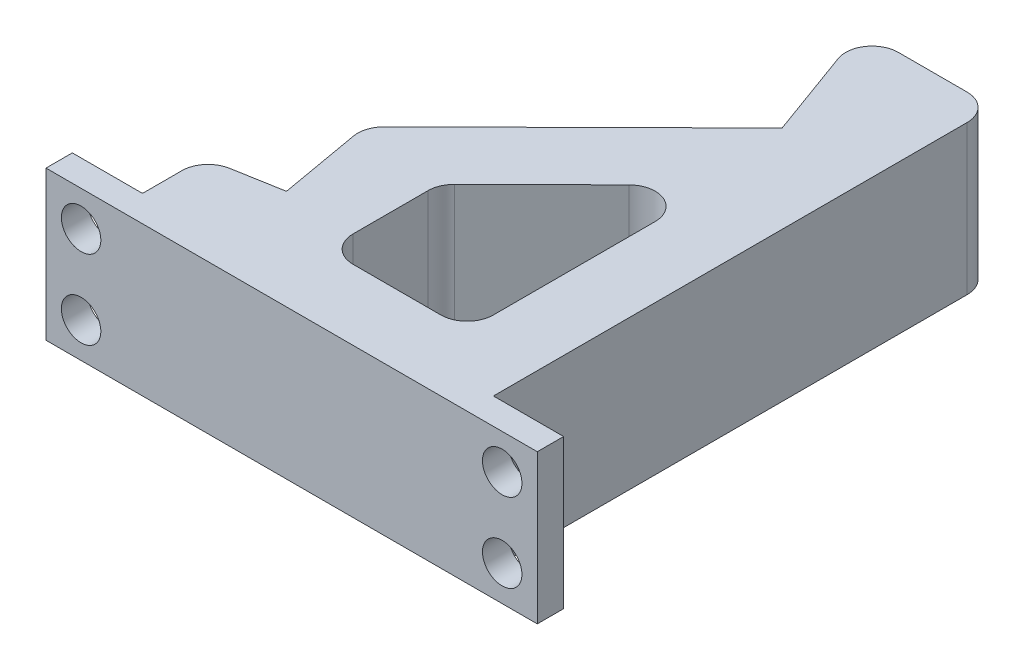
ISO-10303-21;
HEADER;
FILE_DESCRIPTION(('STEP AP214'),'2;1');
FILE_NAME('part.step','',(''),(''),'','','');
FILE_SCHEMA(('AUTOMOTIVE_DESIGN { 1 0 10303 214 1 1 1 1 }'));
ENDSEC;
DATA;
#1=APPLICATION_CONTEXT('core data for automotive mechanical design processes');
#2=APPLICATION_PROTOCOL_DEFINITION('international standard','automotive_design',2000,#1);
#3=PRODUCT_CONTEXT('',#1,'mechanical');
#4=PRODUCT('Part','Part','',(#3));
#5=PRODUCT_RELATED_PRODUCT_CATEGORY('part','',(#4));
#6=PRODUCT_DEFINITION_FORMATION('','',#4);
#7=PRODUCT_DEFINITION_CONTEXT('part definition',#1,'design');
#8=PRODUCT_DEFINITION('design','',#6,#7);
#9=PRODUCT_DEFINITION_SHAPE('','',#8);
#10=(LENGTH_UNIT() NAMED_UNIT(*) SI_UNIT(.MILLI.,.METRE.));
#11=(NAMED_UNIT(*) PLANE_ANGLE_UNIT() SI_UNIT($,.RADIAN.));
#12=(NAMED_UNIT(*) SI_UNIT($,.STERADIAN.) SOLID_ANGLE_UNIT());
#13=UNCERTAINTY_MEASURE_WITH_UNIT(LENGTH_MEASURE(1.E-05),#10,'distance_accuracy_value','');
#14=(GEOMETRIC_REPRESENTATION_CONTEXT(3) GLOBAL_UNCERTAINTY_ASSIGNED_CONTEXT((#13)) GLOBAL_UNIT_ASSIGNED_CONTEXT((#10,
#11,#12)) REPRESENTATION_CONTEXT('',''));
#15=CARTESIAN_POINT('',(0.,0.,0.));
#16=DIRECTION('',(0.,0.,1.));
#17=DIRECTION('',(1.,0.,0.));
#18=AXIS2_PLACEMENT_3D('',#15,#16,#17);
#19=CARTESIAN_POINT('',(0.,8.5,0.));
#20=DIRECTION('',(0.,1.,0.));
#21=DIRECTION('',(0.,0.,1.));
#22=AXIS2_PLACEMENT_3D('',#19,#20,#21);
#23=PLANE('',#22);
#24=DIRECTION('',(1.,0.,0.));
#25=VECTOR('',#24,1.);
#26=CARTESIAN_POINT('',(0.,8.5,0.));
#27=LINE('',#26,#25);
#28=CARTESIAN_POINT('',(-8.,8.5,0.));
#29=VERTEX_POINT('',#28);
#30=CARTESIAN_POINT('',(48.,8.5,0.));
#31=VERTEX_POINT('',#30);
#32=EDGE_CURVE('E280',#29,#31,#27,.T.);
#33=ORIENTED_EDGE('',*,*,#32,.T.);
#34=DIRECTION('',(0.,0.,-1.));
#35=VECTOR('',#34,1.);
#36=CARTESIAN_POINT('',(48.,8.5,0.));
#37=LINE('',#36,#35);
#38=CARTESIAN_POINT('',(48.,8.5,-3.00000000000001));
#39=VERTEX_POINT('',#38);
#40=EDGE_CURVE('E236',#31,#39,#37,.T.);
#41=ORIENTED_EDGE('',*,*,#40,.T.);
#42=DIRECTION('',(-1.,0.,0.));
#43=VECTOR('',#42,1.);
#44=CARTESIAN_POINT('',(40.,8.5,-3.00000000000001));
#45=LINE('',#44,#43);
#46=CARTESIAN_POINT('',(40.,8.5,-3.00000000000001));
#47=VERTEX_POINT('',#46);
#48=EDGE_CURVE('E740',#39,#47,#45,.T.);
#49=ORIENTED_EDGE('',*,*,#48,.T.);
#50=DIRECTION('',(0.,0.,-1.));
#51=VECTOR('',#50,1.);
#52=CARTESIAN_POINT('',(40.,8.5,0.));
#53=LINE('',#52,#51);
#54=CARTESIAN_POINT('',(40.,8.5,-57.));
#55=VERTEX_POINT('',#54);
#56=EDGE_CURVE('E60',#47,#55,#53,.T.);
#57=ORIENTED_EDGE('',*,*,#56,.T.);
#58=CARTESIAN_POINT('',(37.,8.5,-57.));
#59=DIRECTION('',(0.,1.,0.));
#60=DIRECTION('',(0.,0.,1.));
#61=AXIS2_PLACEMENT_3D('',#58,#59,#60);
#62=CIRCLE('',#61,3.);
#63=CARTESIAN_POINT('',(37.,8.5,-60.));
#64=VERTEX_POINT('',#63);
#65=EDGE_CURVE('E339',#55,#64,#62,.T.);
#66=ORIENTED_EDGE('',*,*,#65,.T.);
#67=DIRECTION('',(-1.,0.,0.));
#68=VECTOR('',#67,1.);
#69=CARTESIAN_POINT('',(40.,8.5,-60.));
#70=LINE('',#69,#68);
#71=CARTESIAN_POINT('',(29.1541418703413,8.5,-60.));
#72=VERTEX_POINT('',#71);
#73=EDGE_CURVE('E283',#64,#72,#70,.T.);
#74=ORIENTED_EDGE('',*,*,#73,.T.);
#75=CARTESIAN_POINT('',(29.1541418703413,8.5,-57.));
#76=DIRECTION('',(0.,1.,0.));
#77=DIRECTION('',(0.,0.,1.));
#78=AXIS2_PLACEMENT_3D('',#75,#76,#77);
#79=CIRCLE('',#78,3.);
#80=CARTESIAN_POINT('',(26.3350640079835,8.5,-55.973939570023));
#81=VERTEX_POINT('',#80);
#82=EDGE_CURVE('E333',#72,#81,#79,.T.);
#83=ORIENTED_EDGE('',*,*,#82,.T.);
#84=DIRECTION('',(0.342020143325673,0.,0.939692620785907));
#85=VECTOR('',#84,1.);
#86=CARTESIAN_POINT('',(24.8696978501149,8.5,-60.));
#87=LINE('',#86,#85);
#88=CARTESIAN_POINT('',(30.,8.5,-45.9046106882114));
#89=VERTEX_POINT('',#88);
#90=EDGE_CURVE('E286',#81,#89,#87,.T.);
#91=ORIENTED_EDGE('',*,*,#90,.T.);
#92=DIRECTION('',(-0.710798523017317,0.,0.703395663674721));
#93=VECTOR('',#92,1.);
#94=CARTESIAN_POINT('',(30.,8.5,-45.9046106882114));
#95=LINE('',#94,#93);
#96=CARTESIAN_POINT('',(7.20702820738755,8.5,-23.3490242568743));
#97=VERTEX_POINT('',#96);
#98=EDGE_CURVE('E288',#89,#97,#95,.T.);
#99=ORIENTED_EDGE('',*,*,#98,.T.);
#100=CARTESIAN_POINT('',(9.3172151984117,8.5,-21.2166286878224));
#101=DIRECTION('',(0.,1.,0.));
#102=DIRECTION('',(0.,0.,1.));
#103=AXIS2_PLACEMENT_3D('',#100,#101,#102);
#104=CIRCLE('',#103,3.);
#105=CARTESIAN_POINT('',(6.36279193937507,8.5,-20.6956841548216));
#106=VERTEX_POINT('',#105);
#107=EDGE_CURVE('E335',#97,#106,#104,.T.);
#108=ORIENTED_EDGE('',*,*,#107,.T.);
#109=DIRECTION('',(0.173648177666927,0.,0.984807753012209));
#110=VECTOR('',#109,1.);
#111=CARTESIAN_POINT('',(6.0898700456638,8.5,-22.243501128802));
#112=LINE('',#111,#110);
#113=CARTESIAN_POINT('',(8.,8.5,-11.4106158456677));
#114=VERTEX_POINT('',#113);
#115=EDGE_CURVE('E291',#106,#114,#112,.T.);
#116=ORIENTED_EDGE('',*,*,#115,.T.);
#117=DIRECTION('',(-0.984807753012209,0.,0.173648177666927));
#118=VECTOR('',#117,1.);
#119=CARTESIAN_POINT('',(8.,8.5,-11.4106158456677));
#120=LINE('',#119,#118);
#121=CARTESIAN_POINT('',(2.47905546699922,8.5,-10.4371243655048));
#122=VERTEX_POINT('',#121);
#123=EDGE_CURVE('E293',#114,#122,#120,.T.);
#124=ORIENTED_EDGE('',*,*,#123,.T.);
#125=CARTESIAN_POINT('',(3.,8.5,-7.48270110646815));
#126=DIRECTION('',(0.,1.,0.));
#127=DIRECTION('',(0.,0.,1.));
#128=AXIS2_PLACEMENT_3D('',#125,#126,#127);
#129=CIRCLE('',#128,3.);
#130=CARTESIAN_POINT('',(0.,8.5,-7.48270110646815));
#131=VERTEX_POINT('',#130);
#132=EDGE_CURVE('E337',#122,#131,#129,.T.);
#133=ORIENTED_EDGE('',*,*,#132,.T.);
#134=DIRECTION('',(0.,0.,1.));
#135=VECTOR('',#134,1.);
#136=CARTESIAN_POINT('',(0.,8.5,0.));
#137=LINE('',#136,#135);
#138=CARTESIAN_POINT('',(0.,8.5,-3.));
#139=VERTEX_POINT('',#138);
#140=EDGE_CURVE('E296',#131,#139,#137,.T.);
#141=ORIENTED_EDGE('',*,*,#140,.T.);
#142=DIRECTION('',(-1.,0.,0.));
#143=VECTOR('',#142,1.);
#144=CARTESIAN_POINT('',(0.,8.5,-3.));
#145=LINE('',#144,#143);
#146=CARTESIAN_POINT('',(-8.,8.5,-3.));
#147=VERTEX_POINT('',#146);
#148=EDGE_CURVE('E243',#139,#147,#145,.T.);
#149=ORIENTED_EDGE('',*,*,#148,.T.);
#150=DIRECTION('',(0.,0.,1.));
#151=VECTOR('',#150,1.);
#152=CARTESIAN_POINT('',(-8.,8.5,0.));
#153=LINE('',#152,#151);
#154=EDGE_CURVE('E246',#147,#29,#153,.T.);
#155=ORIENTED_EDGE('',*,*,#154,.T.);
#156=EDGE_LOOP('',(#33,#41,#49,#57,#66,#74,#83,#91,#99,#108,#116,#124,#133,#141,#149,#155));
#157=FACE_BOUND('',#156,.T.);
#158=DIRECTION('',(1.,0.,0.));
#159=VECTOR('',#158,1.);
#160=CARTESIAN_POINT('',(16.,8.5,-8.));
#161=LINE('',#160,#159);
#162=CARTESIAN_POINT('',(19.,8.5,-8.));
#163=VERTEX_POINT('',#162);
#164=CARTESIAN_POINT('',(29.,8.5,-8.));
#165=VERTEX_POINT('',#164);
#166=EDGE_CURVE('E260',#163,#165,#161,.T.);
#167=ORIENTED_EDGE('',*,*,#166,.F.);
#168=CARTESIAN_POINT('',(19.,8.5,-11.));
#169=DIRECTION('',(0.,1.,0.));
#170=DIRECTION('',(0.,0.,1.));
#171=AXIS2_PLACEMENT_3D('',#168,#169,#170);
#172=CIRCLE('',#171,3.);
#173=CARTESIAN_POINT('',(16.,8.5,-11.));
#174=VERTEX_POINT('',#173);
#175=EDGE_CURVE('E375',#163,#174,#172,.F.);
#176=ORIENTED_EDGE('',*,*,#175,.T.);
#177=DIRECTION('',(0.,0.,1.));
#178=VECTOR('',#177,1.);
#179=CARTESIAN_POINT('',(16.,8.5,-20.7954711592154));
#180=LINE('',#179,#178);
#181=CARTESIAN_POINT('',(16.,8.5,-19.5436213309425));
#182=VERTEX_POINT('',#181);
#183=EDGE_CURVE('E257',#182,#174,#180,.T.);
#184=ORIENTED_EDGE('',*,*,#183,.F.);
#185=CARTESIAN_POINT('',(19.,8.5,-19.5436213309425));
#186=DIRECTION('',(0.,1.,0.));
#187=DIRECTION('',(0.,0.,1.));
#188=AXIS2_PLACEMENT_3D('',#185,#186,#187);
#189=CIRCLE('',#188,3.);
#190=CARTESIAN_POINT('',(16.8898130089758,8.5,-21.6760168999945));
#191=VERTEX_POINT('',#190);
#192=EDGE_CURVE('E379',#182,#191,#189,.F.);
#193=ORIENTED_EDGE('',*,*,#192,.T.);
#194=DIRECTION('',(-0.710798523017317,0.,0.703395663674721));
#195=VECTOR('',#194,1.);
#196=CARTESIAN_POINT('',(32.,8.5,-36.628833573956));
#197=LINE('',#196,#195);
#198=CARTESIAN_POINT('',(26.8898130089758,8.5,-31.5718684092074));
#199=VERTEX_POINT('',#198);
#200=EDGE_CURVE('E267',#199,#191,#197,.T.);
#201=ORIENTED_EDGE('',*,*,#200,.F.);
#202=CARTESIAN_POINT('',(29.,8.5,-29.4394728401554));
#203=DIRECTION('',(0.,1.,0.));
#204=DIRECTION('',(0.,0.,1.));
#205=AXIS2_PLACEMENT_3D('',#202,#203,#204);
#206=CIRCLE('',#205,3.);
#207=CARTESIAN_POINT('',(32.,8.5,-29.4394728401554));
#208=VERTEX_POINT('',#207);
#209=EDGE_CURVE('E383',#199,#208,#206,.F.);
#210=ORIENTED_EDGE('',*,*,#209,.T.);
#211=DIRECTION('',(0.,0.,-1.));
#212=VECTOR('',#211,1.);
#213=CARTESIAN_POINT('',(32.,8.5,-8.));
#214=LINE('',#213,#212);
#215=CARTESIAN_POINT('',(32.,8.5,-11.));
#216=VERTEX_POINT('',#215);
#217=EDGE_CURVE('E264',#216,#208,#214,.T.);
#218=ORIENTED_EDGE('',*,*,#217,.F.);
#219=CARTESIAN_POINT('',(29.,8.5,-11.));
#220=DIRECTION('',(0.,1.,0.));
#221=DIRECTION('',(0.,0.,1.));
#222=AXIS2_PLACEMENT_3D('',#219,#220,#221);
#223=CIRCLE('',#222,3.);
#224=EDGE_CURVE('E11',#216,#165,#223,.F.);
#225=ORIENTED_EDGE('',*,*,#224,.T.);
#226=EDGE_LOOP('',(#167,#176,#184,#193,#201,#210,#218,#225));
#227=FACE_BOUND('',#226,.T.);
#228=ADVANCED_FACE('F45',(#157,#227),#23,.T.);
#229=CARTESIAN_POINT('',(0.,-8.5,0.));
#230=DIRECTION('',(0.,1.,0.));
#231=DIRECTION('',(0.,0.,1.));
#232=AXIS2_PLACEMENT_3D('',#229,#230,#231);
#233=PLANE('',#232);
#234=DIRECTION('',(-1.,0.,0.));
#235=VECTOR('',#234,1.);
#236=CARTESIAN_POINT('',(40.,-8.5,-60.));
#237=LINE('',#236,#235);
#238=CARTESIAN_POINT('',(37.,-8.5,-60.));
#239=VERTEX_POINT('',#238);
#240=CARTESIAN_POINT('',(29.1541418703413,-8.5,-60.));
#241=VERTEX_POINT('',#240);
#242=EDGE_CURVE('E216',#239,#241,#237,.T.);
#243=ORIENTED_EDGE('',*,*,#242,.F.);
#244=CARTESIAN_POINT('',(37.,-8.5,-57.));
#245=DIRECTION('',(0.,1.,0.));
#246=DIRECTION('',(0.,0.,1.));
#247=AXIS2_PLACEMENT_3D('',#244,#245,#246);
#248=CIRCLE('',#247,3.);
#249=CARTESIAN_POINT('',(40.,-8.5,-57.));
#250=VERTEX_POINT('',#249);
#251=EDGE_CURVE('E214',#239,#250,#248,.F.);
#252=ORIENTED_EDGE('',*,*,#251,.T.);
#253=DIRECTION('',(0.,0.,-1.));
#254=VECTOR('',#253,1.);
#255=CARTESIAN_POINT('',(40.,-8.5,0.));
#256=LINE('',#255,#254);
#257=CARTESIAN_POINT('',(40.,-8.5,-3.00000000000001));
#258=VERTEX_POINT('',#257);
#259=EDGE_CURVE('E206',#258,#250,#256,.T.);
#260=ORIENTED_EDGE('',*,*,#259,.F.);
#261=DIRECTION('',(1.,0.,0.));
#262=VECTOR('',#261,1.);
#263=CARTESIAN_POINT('',(40.,-8.5,-3.00000000000001));
#264=LINE('',#263,#262);
#265=CARTESIAN_POINT('',(48.,-8.5,-3.00000000000001));
#266=VERTEX_POINT('',#265);
#267=EDGE_CURVE('E212',#258,#266,#264,.T.);
#268=ORIENTED_EDGE('',*,*,#267,.T.);
#269=DIRECTION('',(0.,0.,1.));
#270=VECTOR('',#269,1.);
#271=CARTESIAN_POINT('',(48.,-8.5,0.));
#272=LINE('',#271,#270);
#273=CARTESIAN_POINT('',(48.,-8.5,0.));
#274=VERTEX_POINT('',#273);
#275=EDGE_CURVE('E225',#266,#274,#272,.T.);
#276=ORIENTED_EDGE('',*,*,#275,.T.);
#277=DIRECTION('',(1.,0.,0.));
#278=VECTOR('',#277,1.);
#279=CARTESIAN_POINT('',(0.,-8.5,0.));
#280=LINE('',#279,#278);
#281=CARTESIAN_POINT('',(-8.,-8.5,0.));
#282=VERTEX_POINT('',#281);
#283=EDGE_CURVE('E217',#282,#274,#280,.T.);
#284=ORIENTED_EDGE('',*,*,#283,.F.);
#285=DIRECTION('',(0.,0.,-1.));
#286=VECTOR('',#285,1.);
#287=CARTESIAN_POINT('',(-8.,-8.5,0.));
#288=LINE('',#287,#286);
#289=CARTESIAN_POINT('',(-8.,-8.5,-3.));
#290=VERTEX_POINT('',#289);
#291=EDGE_CURVE('E239',#282,#290,#288,.T.);
#292=ORIENTED_EDGE('',*,*,#291,.T.);
#293=DIRECTION('',(1.,0.,0.));
#294=VECTOR('',#293,1.);
#295=CARTESIAN_POINT('',(0.,-8.5,-3.));
#296=LINE('',#295,#294);
#297=CARTESIAN_POINT('',(0.,-8.5,-3.));
#298=VERTEX_POINT('',#297);
#299=EDGE_CURVE('E241',#290,#298,#296,.T.);
#300=ORIENTED_EDGE('',*,*,#299,.T.);
#301=DIRECTION('',(0.,0.,1.));
#302=VECTOR('',#301,1.);
#303=CARTESIAN_POINT('',(0.,-8.5,0.));
#304=LINE('',#303,#302);
#305=CARTESIAN_POINT('',(0.,-8.5,-7.48270110646815));
#306=VERTEX_POINT('',#305);
#307=EDGE_CURVE('E68',#306,#298,#304,.T.);
#308=ORIENTED_EDGE('',*,*,#307,.F.);
#309=CARTESIAN_POINT('',(3.,-8.5,-7.48270110646815));
#310=DIRECTION('',(0.,1.,0.));
#311=DIRECTION('',(0.,0.,1.));
#312=AXIS2_PLACEMENT_3D('',#309,#310,#311);
#313=CIRCLE('',#312,3.);
#314=CARTESIAN_POINT('',(2.47905546699922,-8.5,-10.4371243655048));
#315=VERTEX_POINT('',#314);
#316=EDGE_CURVE('E328',#306,#315,#313,.F.);
#317=ORIENTED_EDGE('',*,*,#316,.T.);
#318=DIRECTION('',(-0.984807753012209,0.,0.173648177666927));
#319=VECTOR('',#318,1.);
#320=CARTESIAN_POINT('',(8.,-8.5,-11.4106158456677));
#321=LINE('',#320,#319);
#322=CARTESIAN_POINT('',(8.,-8.5,-11.4106158456677));
#323=VERTEX_POINT('',#322);
#324=EDGE_CURVE('E310',#323,#315,#321,.T.);
#325=ORIENTED_EDGE('',*,*,#324,.F.);
#326=DIRECTION('',(0.173648177666927,0.,0.984807753012209));
#327=VECTOR('',#326,1.);
#328=CARTESIAN_POINT('',(6.0898700456638,-8.5,-22.243501128802));
#329=LINE('',#328,#327);
#330=CARTESIAN_POINT('',(6.36279193937507,-8.5,-20.6956841548216));
#331=VERTEX_POINT('',#330);
#332=EDGE_CURVE('E308',#331,#323,#329,.T.);
#333=ORIENTED_EDGE('',*,*,#332,.F.);
#334=CARTESIAN_POINT('',(9.3172151984117,-8.5,-21.2166286878224));
#335=DIRECTION('',(0.,1.,0.));
#336=DIRECTION('',(0.,0.,1.));
#337=AXIS2_PLACEMENT_3D('',#334,#335,#336);
#338=CIRCLE('',#337,3.);
#339=CARTESIAN_POINT('',(7.20702820738755,-8.5,-23.3490242568743));
#340=VERTEX_POINT('',#339);
#341=EDGE_CURVE('E326',#331,#340,#338,.F.);
#342=ORIENTED_EDGE('',*,*,#341,.T.);
#343=DIRECTION('',(-0.710798523017317,0.,0.703395663674721));
#344=VECTOR('',#343,1.);
#345=CARTESIAN_POINT('',(30.,-8.5,-45.9046106882114));
#346=LINE('',#345,#344);
#347=CARTESIAN_POINT('',(30.,-8.5,-45.9046106882114));
#348=VERTEX_POINT('',#347);
#349=EDGE_CURVE('E305',#348,#340,#346,.T.);
#350=ORIENTED_EDGE('',*,*,#349,.F.);
#351=DIRECTION('',(0.342020143325673,0.,0.939692620785907));
#352=VECTOR('',#351,1.);
#353=CARTESIAN_POINT('',(24.8696978501149,-8.5,-60.));
#354=LINE('',#353,#352);
#355=CARTESIAN_POINT('',(26.3350640079835,-8.5,-55.973939570023));
#356=VERTEX_POINT('',#355);
#357=EDGE_CURVE('E303',#356,#348,#354,.T.);
#358=ORIENTED_EDGE('',*,*,#357,.F.);
#359=CARTESIAN_POINT('',(29.1541418703413,-8.5,-57.));
#360=DIRECTION('',(0.,1.,0.));
#361=DIRECTION('',(0.,0.,1.));
#362=AXIS2_PLACEMENT_3D('',#359,#360,#361);
#363=CIRCLE('',#362,3.);
#364=EDGE_CURVE('E324',#356,#241,#363,.F.);
#365=ORIENTED_EDGE('',*,*,#364,.T.);
#366=EDGE_LOOP('',(#243,#252,#260,#268,#276,#284,#292,#300,#308,#317,#325,#333,#342,#350,#358,#365));
#367=FACE_BOUND('',#366,.T.);
#368=DIRECTION('',(-0.710798523017317,0.,0.703395663674721));
#369=VECTOR('',#368,1.);
#370=CARTESIAN_POINT('',(32.,-8.5,-36.628833573956));
#371=LINE('',#370,#369);
#372=CARTESIAN_POINT('',(26.8898130089758,-8.5,-31.5718684092074));
#373=VERTEX_POINT('',#372);
#374=CARTESIAN_POINT('',(16.8898130089758,-8.5,-21.6760168999945));
#375=VERTEX_POINT('',#374);
#376=EDGE_CURVE('E261',#373,#375,#371,.T.);
#377=ORIENTED_EDGE('',*,*,#376,.T.);
#378=CARTESIAN_POINT('',(19.,-8.5,-19.5436213309425));
#379=DIRECTION('',(0.,1.,0.));
#380=DIRECTION('',(0.,0.,1.));
#381=AXIS2_PLACEMENT_3D('',#378,#379,#380);
#382=CIRCLE('',#381,3.);
#383=CARTESIAN_POINT('',(16.,-8.5,-19.5436213309425));
#384=VERTEX_POINT('',#383);
#385=EDGE_CURVE('E377',#375,#384,#382,.T.);
#386=ORIENTED_EDGE('',*,*,#385,.T.);
#387=DIRECTION('',(0.,0.,1.));
#388=VECTOR('',#387,1.);
#389=CARTESIAN_POINT('',(16.,-8.5,-20.7954711592154));
#390=LINE('',#389,#388);
#391=CARTESIAN_POINT('',(16.,-8.5,-11.));
#392=VERTEX_POINT('',#391);
#393=EDGE_CURVE('E256',#384,#392,#390,.T.);
#394=ORIENTED_EDGE('',*,*,#393,.T.);
#395=CARTESIAN_POINT('',(19.,-8.5,-11.));
#396=DIRECTION('',(0.,1.,0.));
#397=DIRECTION('',(0.,0.,1.));
#398=AXIS2_PLACEMENT_3D('',#395,#396,#397);
#399=CIRCLE('',#398,3.);
#400=CARTESIAN_POINT('',(19.,-8.5,-8.));
#401=VERTEX_POINT('',#400);
#402=EDGE_CURVE('E373',#392,#401,#399,.T.);
#403=ORIENTED_EDGE('',*,*,#402,.T.);
#404=DIRECTION('',(1.,0.,0.));
#405=VECTOR('',#404,1.);
#406=CARTESIAN_POINT('',(16.,-8.5,-8.));
#407=LINE('',#406,#405);
#408=CARTESIAN_POINT('',(29.,-8.5,-8.));
#409=VERTEX_POINT('',#408);
#410=EDGE_CURVE('E272',#401,#409,#407,.T.);
#411=ORIENTED_EDGE('',*,*,#410,.T.);
#412=CARTESIAN_POINT('',(29.,-8.5,-11.));
#413=DIRECTION('',(0.,1.,0.));
#414=DIRECTION('',(0.,0.,1.));
#415=AXIS2_PLACEMENT_3D('',#412,#413,#414);
#416=CIRCLE('',#415,3.);
#417=CARTESIAN_POINT('',(32.,-8.5,-11.));
#418=VERTEX_POINT('',#417);
#419=EDGE_CURVE('E53',#409,#418,#416,.T.);
#420=ORIENTED_EDGE('',*,*,#419,.T.);
#421=DIRECTION('',(0.,0.,-1.));
#422=VECTOR('',#421,1.);
#423=CARTESIAN_POINT('',(32.,-8.5,-8.));
#424=LINE('',#423,#422);
#425=CARTESIAN_POINT('',(32.,-8.5,-29.4394728401554));
#426=VERTEX_POINT('',#425);
#427=EDGE_CURVE('E275',#418,#426,#424,.T.);
#428=ORIENTED_EDGE('',*,*,#427,.T.);
#429=CARTESIAN_POINT('',(29.,-8.5,-29.4394728401554));
#430=DIRECTION('',(0.,1.,0.));
#431=DIRECTION('',(0.,0.,1.));
#432=AXIS2_PLACEMENT_3D('',#429,#430,#431);
#433=CIRCLE('',#432,3.);
#434=EDGE_CURVE('E381',#426,#373,#433,.T.);
#435=ORIENTED_EDGE('',*,*,#434,.T.);
#436=EDGE_LOOP('',(#377,#386,#394,#403,#411,#420,#428,#435));
#437=FACE_BOUND('',#436,.T.);
#438=ADVANCED_FACE('F208',(#367,#437),#233,.F.);
#439=CARTESIAN_POINT('',(0.,8.5,0.));
#440=DIRECTION('',(0.,0.,-1.));
#441=DIRECTION('',(-1.,0.,0.));
#442=AXIS2_PLACEMENT_3D('',#439,#440,#441);
#443=PLANE('',#442);
#444=CARTESIAN_POINT('',(44.,-4.5,0.));
#445=DIRECTION('',(0.,0.,-1.));
#446=DIRECTION('',(-1.,0.,0.));
#447=AXIS2_PLACEMENT_3D('',#444,#445,#446);
#448=CIRCLE('',#447,2.25);
#449=CARTESIAN_POINT('',(41.75,-4.5,0.));
#450=VERTEX_POINT('',#449);
#451=EDGE_CURVE('E734',#450,#450,#448,.T.);
#452=ORIENTED_EDGE('',*,*,#451,.T.);
#453=EDGE_LOOP('',(#452));
#454=FACE_BOUND('',#453,.T.);
#455=CARTESIAN_POINT('',(44.,4.5,0.));
#456=DIRECTION('',(0.,0.,-1.));
#457=DIRECTION('',(-1.,0.,0.));
#458=AXIS2_PLACEMENT_3D('',#455,#456,#457);
#459=CIRCLE('',#458,2.25);
#460=CARTESIAN_POINT('',(41.75,4.5,0.));
#461=VERTEX_POINT('',#460);
#462=EDGE_CURVE('E728',#461,#461,#459,.T.);
#463=ORIENTED_EDGE('',*,*,#462,.T.);
#464=EDGE_LOOP('',(#463));
#465=FACE_BOUND('',#464,.T.);
#466=CARTESIAN_POINT('',(-4.,4.5,0.));
#467=DIRECTION('',(0.,0.,-1.));
#468=DIRECTION('',(-1.,0.,0.));
#469=AXIS2_PLACEMENT_3D('',#466,#467,#468);
#470=CIRCLE('',#469,2.25);
#471=CARTESIAN_POINT('',(-6.25,4.5,0.));
#472=VERTEX_POINT('',#471);
#473=EDGE_CURVE('E716',#472,#472,#470,.T.);
#474=ORIENTED_EDGE('',*,*,#473,.T.);
#475=EDGE_LOOP('',(#474));
#476=FACE_BOUND('',#475,.T.);
#477=CARTESIAN_POINT('',(-4.,-4.5,0.));
#478=DIRECTION('',(0.,0.,-1.));
#479=DIRECTION('',(-1.,0.,0.));
#480=AXIS2_PLACEMENT_3D('',#477,#478,#479);
#481=CIRCLE('',#480,2.25);
#482=CARTESIAN_POINT('',(-6.25,-4.5,0.));
#483=VERTEX_POINT('',#482);
#484=EDGE_CURVE('E229',#483,#483,#481,.T.);
#485=ORIENTED_EDGE('',*,*,#484,.T.);
#486=EDGE_LOOP('',(#485));
#487=FACE_BOUND('',#486,.T.);
#488=ORIENTED_EDGE('',*,*,#283,.T.);
#489=DIRECTION('',(0.,1.,0.));
#490=VECTOR('',#489,1.);
#491=CARTESIAN_POINT('',(48.,-17.0440037453175,0.));
#492=LINE('',#491,#490);
#493=EDGE_CURVE('E737',#274,#31,#492,.T.);
#494=ORIENTED_EDGE('',*,*,#493,.T.);
#495=ORIENTED_EDGE('',*,*,#32,.F.);
#496=DIRECTION('',(0.,1.,0.));
#497=VECTOR('',#496,1.);
#498=CARTESIAN_POINT('',(-8.,-17.0440037453175,0.));
#499=LINE('',#498,#497);
#500=EDGE_CURVE('E242',#282,#29,#499,.T.);
#501=ORIENTED_EDGE('',*,*,#500,.F.);
#502=EDGE_LOOP('',(#488,#494,#495,#501));
#503=FACE_BOUND('',#502,.T.);
#504=ADVANCED_FACE('F437',(#454,#465,#476,#487,#503),#443,.F.);
#505=CARTESIAN_POINT('',(40.,8.5,0.));
#506=DIRECTION('',(-1.,0.,0.));
#507=DIRECTION('',(0.,0.,1.));
#508=AXIS2_PLACEMENT_3D('',#505,#506,#507);
#509=PLANE('',#508);
#510=ORIENTED_EDGE('',*,*,#56,.F.);
#511=DIRECTION('',(0.,1.,0.));
#512=VECTOR('',#511,1.);
#513=CARTESIAN_POINT('',(40.,-17.0440037453175,-3.00000000000001));
#514=LINE('',#513,#512);
#515=EDGE_CURVE('E219',#258,#47,#514,.T.);
#516=ORIENTED_EDGE('',*,*,#515,.F.);
#517=ORIENTED_EDGE('',*,*,#259,.T.);
#518=DIRECTION('',(0.,-1.,0.));
#519=VECTOR('',#518,1.);
#520=CARTESIAN_POINT('',(40.,8.5,-57.));
#521=LINE('',#520,#519);
#522=EDGE_CURVE('E331',#250,#55,#521,.F.);
#523=ORIENTED_EDGE('',*,*,#522,.T.);
#524=EDGE_LOOP('',(#510,#516,#517,#523));
#525=FACE_BOUND('',#524,.T.);
#526=ADVANCED_FACE('F220',(#525),#509,.F.);
#527=CARTESIAN_POINT('',(40.,8.5,-60.));
#528=DIRECTION('',(0.,0.,1.));
#529=DIRECTION('',(1.,0.,0.));
#530=AXIS2_PLACEMENT_3D('',#527,#528,#529);
#531=PLANE('',#530);
#532=ORIENTED_EDGE('',*,*,#73,.F.);
#533=DIRECTION('',(0.,-1.,0.));
#534=VECTOR('',#533,1.);
#535=CARTESIAN_POINT('',(37.,8.5,-60.));
#536=LINE('',#535,#534);
#537=EDGE_CURVE('E321',#64,#239,#536,.T.);
#538=ORIENTED_EDGE('',*,*,#537,.T.);
#539=ORIENTED_EDGE('',*,*,#242,.T.);
#540=DIRECTION('',(0.,-1.,0.));
#541=VECTOR('',#540,1.);
#542=CARTESIAN_POINT('',(29.1541418703413,8.5,-60.));
#543=LINE('',#542,#541);
#544=EDGE_CURVE('E319',#241,#72,#543,.F.);
#545=ORIENTED_EDGE('',*,*,#544,.T.);
#546=EDGE_LOOP('',(#532,#538,#539,#545));
#547=FACE_BOUND('',#546,.T.);
#548=ADVANCED_FACE('F460',(#547),#531,.F.);
#549=CARTESIAN_POINT('',(24.8696978501149,8.5,-60.));
#550=DIRECTION('',(0.939692620785907,0.,-0.342020143325673));
#551=DIRECTION('',(-0.342020143325673,0.,-0.939692620785907));
#552=AXIS2_PLACEMENT_3D('',#549,#550,#551);
#553=PLANE('',#552);
#554=ORIENTED_EDGE('',*,*,#90,.F.);
#555=DIRECTION('',(0.,-1.,0.));
#556=VECTOR('',#555,1.);
#557=CARTESIAN_POINT('',(26.3350640079835,8.5,-55.973939570023));
#558=LINE('',#557,#556);
#559=EDGE_CURVE('E370',#81,#356,#558,.T.);
#560=ORIENTED_EDGE('',*,*,#559,.T.);
#561=ORIENTED_EDGE('',*,*,#357,.T.);
#562=DIRECTION('',(0.,-1.,0.));
#563=VECTOR('',#562,1.);
#564=CARTESIAN_POINT('',(30.,8.5,-45.9046106882114));
#565=LINE('',#564,#563);
#566=EDGE_CURVE('E316',#89,#348,#565,.T.);
#567=ORIENTED_EDGE('',*,*,#566,.F.);
#568=EDGE_LOOP('',(#554,#560,#561,#567));
#569=FACE_BOUND('',#568,.T.);
#570=ADVANCED_FACE('F456',(#569),#553,.F.);
#571=CARTESIAN_POINT('',(30.,8.5,-45.9046106882114));
#572=DIRECTION('',(0.703395663674721,0.,0.710798523017317));
#573=DIRECTION('',(0.710798523017317,0.,-0.703395663674721));
#574=AXIS2_PLACEMENT_3D('',#571,#572,#573);
#575=PLANE('',#574);
#576=ORIENTED_EDGE('',*,*,#349,.T.);
#577=DIRECTION('',(0.,-1.,0.));
#578=VECTOR('',#577,1.);
#579=CARTESIAN_POINT('',(7.20702820738753,8.5,-23.3490242568743));
#580=LINE('',#579,#578);
#581=EDGE_CURVE('E368',#340,#97,#580,.F.);
#582=ORIENTED_EDGE('',*,*,#581,.T.);
#583=ORIENTED_EDGE('',*,*,#98,.F.);
#584=ORIENTED_EDGE('',*,*,#566,.T.);
#585=EDGE_LOOP('',(#576,#582,#583,#584));
#586=FACE_BOUND('',#585,.T.);
#587=ADVANCED_FACE('F452',(#586),#575,.F.);
#588=CARTESIAN_POINT('',(6.0898700456638,8.5,-22.243501128802));
#589=DIRECTION('',(0.984807753012209,0.,-0.173648177666927));
#590=DIRECTION('',(-0.173648177666927,0.,-0.984807753012209));
#591=AXIS2_PLACEMENT_3D('',#588,#589,#590);
#592=PLANE('',#591);
#593=ORIENTED_EDGE('',*,*,#115,.F.);
#594=DIRECTION('',(0.,-1.,0.));
#595=VECTOR('',#594,1.);
#596=CARTESIAN_POINT('',(6.36279193937507,8.5,-20.6956841548216));
#597=LINE('',#596,#595);
#598=EDGE_CURVE('E365',#106,#331,#597,.T.);
#599=ORIENTED_EDGE('',*,*,#598,.T.);
#600=ORIENTED_EDGE('',*,*,#332,.T.);
#601=DIRECTION('',(0.,-1.,0.));
#602=VECTOR('',#601,1.);
#603=CARTESIAN_POINT('',(8.,8.5,-11.4106158456677));
#604=LINE('',#603,#602);
#605=EDGE_CURVE('E299',#114,#323,#604,.T.);
#606=ORIENTED_EDGE('',*,*,#605,.F.);
#607=EDGE_LOOP('',(#593,#599,#600,#606));
#608=FACE_BOUND('',#607,.T.);
#609=ADVANCED_FACE('F448',(#608),#592,.F.);
#610=CARTESIAN_POINT('',(8.,8.5,-11.4106158456677));
#611=DIRECTION('',(0.173648177666927,0.,0.984807753012209));
#612=DIRECTION('',(0.984807753012209,0.,-0.173648177666927));
#613=AXIS2_PLACEMENT_3D('',#610,#611,#612);
#614=PLANE('',#613);
#615=ORIENTED_EDGE('',*,*,#324,.T.);
#616=DIRECTION('',(0.,-1.,0.));
#617=VECTOR('',#616,1.);
#618=CARTESIAN_POINT('',(2.47905546699922,8.5,-10.4371243655048));
#619=LINE('',#618,#617);
#620=EDGE_CURVE('E363',#315,#122,#619,.F.);
#621=ORIENTED_EDGE('',*,*,#620,.T.);
#622=ORIENTED_EDGE('',*,*,#123,.F.);
#623=ORIENTED_EDGE('',*,*,#605,.T.);
#624=EDGE_LOOP('',(#615,#621,#622,#623));
#625=FACE_BOUND('',#624,.T.);
#626=ADVANCED_FACE('F445',(#625),#614,.F.);
#627=CARTESIAN_POINT('',(0.,8.5,0.));
#628=DIRECTION('',(1.,0.,0.));
#629=DIRECTION('',(0.,0.,-1.));
#630=AXIS2_PLACEMENT_3D('',#627,#628,#629);
#631=PLANE('',#630);
#632=ORIENTED_EDGE('',*,*,#307,.T.);
#633=DIRECTION('',(0.,1.,0.));
#634=VECTOR('',#633,1.);
#635=CARTESIAN_POINT('',(0.,-17.0440037453175,-3.));
#636=LINE('',#635,#634);
#637=EDGE_CURVE('E249',#298,#139,#636,.T.);
#638=ORIENTED_EDGE('',*,*,#637,.T.);
#639=ORIENTED_EDGE('',*,*,#140,.F.);
#640=DIRECTION('',(0.,-1.,0.));
#641=VECTOR('',#640,1.);
#642=CARTESIAN_POINT('',(0.,8.5,-7.48270110646815));
#643=LINE('',#642,#641);
#644=EDGE_CURVE('E361',#131,#306,#643,.T.);
#645=ORIENTED_EDGE('',*,*,#644,.T.);
#646=EDGE_LOOP('',(#632,#638,#639,#645));
#647=FACE_BOUND('',#646,.T.);
#648=ADVANCED_FACE('F442',(#647),#631,.F.);
#649=CARTESIAN_POINT('',(16.,8.5,-20.7954711592154));
#650=DIRECTION('',(1.,0.,0.));
#651=DIRECTION('',(0.,0.,-1.));
#652=AXIS2_PLACEMENT_3D('',#649,#650,#651);
#653=PLANE('',#652);
#654=ORIENTED_EDGE('',*,*,#183,.T.);
#655=DIRECTION('',(0.,-1.,0.));
#656=VECTOR('',#655,1.);
#657=CARTESIAN_POINT('',(16.,-8.5,-11.));
#658=LINE('',#657,#656);
#659=EDGE_CURVE('E343',#174,#392,#658,.T.);
#660=ORIENTED_EDGE('',*,*,#659,.T.);
#661=ORIENTED_EDGE('',*,*,#393,.F.);
#662=DIRECTION('',(0.,-1.,0.));
#663=VECTOR('',#662,1.);
#664=CARTESIAN_POINT('',(16.,8.5,-19.5436213309425));
#665=LINE('',#664,#663);
#666=EDGE_CURVE('E341',#384,#182,#665,.F.);
#667=ORIENTED_EDGE('',*,*,#666,.T.);
#668=EDGE_LOOP('',(#654,#660,#661,#667));
#669=FACE_BOUND('',#668,.T.);
#670=ADVANCED_FACE('F407',(#669),#653,.T.);
#671=CARTESIAN_POINT('',(16.,8.5,-8.));
#672=DIRECTION('',(0.,0.,-1.));
#673=DIRECTION('',(-1.,0.,0.));
#674=AXIS2_PLACEMENT_3D('',#671,#672,#673);
#675=PLANE('',#674);
#676=ORIENTED_EDGE('',*,*,#410,.F.);
#677=DIRECTION('',(0.,-1.,0.));
#678=VECTOR('',#677,1.);
#679=CARTESIAN_POINT('',(19.,8.5,-8.));
#680=LINE('',#679,#678);
#681=EDGE_CURVE('E349',#401,#163,#680,.F.);
#682=ORIENTED_EDGE('',*,*,#681,.T.);
#683=ORIENTED_EDGE('',*,*,#166,.T.);
#684=DIRECTION('',(0.,-1.,0.));
#685=VECTOR('',#684,1.);
#686=CARTESIAN_POINT('',(29.,-8.5,-8.));
#687=LINE('',#686,#685);
#688=EDGE_CURVE('E346',#165,#409,#687,.T.);
#689=ORIENTED_EDGE('',*,*,#688,.T.);
#690=EDGE_LOOP('',(#676,#682,#683,#689));
#691=FACE_BOUND('',#690,.T.);
#692=ADVANCED_FACE('F399',(#691),#675,.T.);
#693=CARTESIAN_POINT('',(32.,8.5,-8.));
#694=DIRECTION('',(-1.,0.,0.));
#695=DIRECTION('',(0.,0.,1.));
#696=AXIS2_PLACEMENT_3D('',#693,#694,#695);
#697=PLANE('',#696);
#698=ORIENTED_EDGE('',*,*,#217,.T.);
#699=DIRECTION('',(0.,-1.,0.));
#700=VECTOR('',#699,1.);
#701=CARTESIAN_POINT('',(32.,-8.5,-29.4394728401554));
#702=LINE('',#701,#700);
#703=EDGE_CURVE('E358',#208,#426,#702,.T.);
#704=ORIENTED_EDGE('',*,*,#703,.T.);
#705=ORIENTED_EDGE('',*,*,#427,.F.);
#706=DIRECTION('',(0.,-1.,0.));
#707=VECTOR('',#706,1.);
#708=CARTESIAN_POINT('',(32.,8.5,-11.));
#709=LINE('',#708,#707);
#710=EDGE_CURVE('E356',#418,#216,#709,.F.);
#711=ORIENTED_EDGE('',*,*,#710,.T.);
#712=EDGE_LOOP('',(#698,#704,#705,#711));
#713=FACE_BOUND('',#712,.T.);
#714=ADVANCED_FACE('F390',(#713),#697,.T.);
#715=CARTESIAN_POINT('',(32.,8.5,-36.628833573956));
#716=DIRECTION('',(0.703395663674721,0.,0.710798523017317));
#717=DIRECTION('',(0.710798523017317,0.,-0.703395663674721));
#718=AXIS2_PLACEMENT_3D('',#715,#716,#717);
#719=PLANE('',#718);
#720=ORIENTED_EDGE('',*,*,#200,.T.);
#721=DIRECTION('',(0.,-1.,0.));
#722=VECTOR('',#721,1.);
#723=CARTESIAN_POINT('',(16.8898130089758,-8.5,-21.6760168999945));
#724=LINE('',#723,#722);
#725=EDGE_CURVE('E353',#191,#375,#724,.T.);
#726=ORIENTED_EDGE('',*,*,#725,.T.);
#727=ORIENTED_EDGE('',*,*,#376,.F.);
#728=DIRECTION('',(0.,-1.,0.));
#729=VECTOR('',#728,1.);
#730=CARTESIAN_POINT('',(26.8898130089758,8.5,-31.5718684092074));
#731=LINE('',#730,#729);
#732=EDGE_CURVE('E351',#373,#199,#731,.F.);
#733=ORIENTED_EDGE('',*,*,#732,.T.);
#734=EDGE_LOOP('',(#720,#726,#727,#733));
#735=FACE_BOUND('',#734,.T.);
#736=ADVANCED_FACE('F416',(#735),#719,.T.);
#737=CARTESIAN_POINT('',(37.,8.5,-57.));
#738=DIRECTION('',(0.,-1.,0.));
#739=DIRECTION('',(0.,0.,-1.));
#740=AXIS2_PLACEMENT_3D('',#737,#738,#739);
#741=CYLINDRICAL_SURFACE('',#740,3.);
#742=ORIENTED_EDGE('',*,*,#65,.F.);
#743=ORIENTED_EDGE('',*,*,#522,.F.);
#744=ORIENTED_EDGE('',*,*,#251,.F.);
#745=ORIENTED_EDGE('',*,*,#537,.F.);
#746=EDGE_LOOP('',(#742,#743,#744,#745));
#747=FACE_BOUND('',#746,.T.);
#748=ADVANCED_FACE('F470',(#747),#741,.T.);
#749=CARTESIAN_POINT('',(19.,8.5,-11.));
#750=DIRECTION('',(0.,1.,0.));
#751=DIRECTION('',(0.,0.,1.));
#752=AXIS2_PLACEMENT_3D('',#749,#750,#751);
#753=CYLINDRICAL_SURFACE('',#752,3.);
#754=ORIENTED_EDGE('',*,*,#175,.F.);
#755=ORIENTED_EDGE('',*,*,#681,.F.);
#756=ORIENTED_EDGE('',*,*,#402,.F.);
#757=ORIENTED_EDGE('',*,*,#659,.F.);
#758=EDGE_LOOP('',(#754,#755,#756,#757));
#759=FACE_BOUND('',#758,.T.);
#760=ADVANCED_FACE('F402',(#759),#753,.F.);
#761=CARTESIAN_POINT('',(19.,8.5,-19.5436213309425));
#762=DIRECTION('',(0.,1.,0.));
#763=DIRECTION('',(0.,0.,1.));
#764=AXIS2_PLACEMENT_3D('',#761,#762,#763);
#765=CYLINDRICAL_SURFACE('',#764,3.);
#766=ORIENTED_EDGE('',*,*,#192,.F.);
#767=ORIENTED_EDGE('',*,*,#666,.F.);
#768=ORIENTED_EDGE('',*,*,#385,.F.);
#769=ORIENTED_EDGE('',*,*,#725,.F.);
#770=EDGE_LOOP('',(#766,#767,#768,#769));
#771=FACE_BOUND('',#770,.T.);
#772=ADVANCED_FACE('F411',(#771),#765,.F.);
#773=CARTESIAN_POINT('',(29.,8.5,-29.4394728401554));
#774=DIRECTION('',(0.,1.,0.));
#775=DIRECTION('',(0.,0.,1.));
#776=AXIS2_PLACEMENT_3D('',#773,#774,#775);
#777=CYLINDRICAL_SURFACE('',#776,3.);
#778=ORIENTED_EDGE('',*,*,#209,.F.);
#779=ORIENTED_EDGE('',*,*,#732,.F.);
#780=ORIENTED_EDGE('',*,*,#434,.F.);
#781=ORIENTED_EDGE('',*,*,#703,.F.);
#782=EDGE_LOOP('',(#778,#779,#780,#781));
#783=FACE_BOUND('',#782,.T.);
#784=ADVANCED_FACE('F420',(#783),#777,.F.);
#785=CARTESIAN_POINT('',(29.,8.5,-11.));
#786=DIRECTION('',(0.,1.,0.));
#787=DIRECTION('',(0.,0.,1.));
#788=AXIS2_PLACEMENT_3D('',#785,#786,#787);
#789=CYLINDRICAL_SURFACE('',#788,3.);
#790=ORIENTED_EDGE('',*,*,#224,.F.);
#791=ORIENTED_EDGE('',*,*,#710,.F.);
#792=ORIENTED_EDGE('',*,*,#419,.F.);
#793=ORIENTED_EDGE('',*,*,#688,.F.);
#794=EDGE_LOOP('',(#790,#791,#792,#793));
#795=FACE_BOUND('',#794,.T.);
#796=ADVANCED_FACE('F394',(#795),#789,.F.);
#797=CARTESIAN_POINT('',(3.,8.5,-7.48270110646815));
#798=DIRECTION('',(0.,-1.,0.));
#799=DIRECTION('',(0.,0.,-1.));
#800=AXIS2_PLACEMENT_3D('',#797,#798,#799);
#801=CYLINDRICAL_SURFACE('',#800,3.);
#802=ORIENTED_EDGE('',*,*,#132,.F.);
#803=ORIENTED_EDGE('',*,*,#620,.F.);
#804=ORIENTED_EDGE('',*,*,#316,.F.);
#805=ORIENTED_EDGE('',*,*,#644,.F.);
#806=EDGE_LOOP('',(#802,#803,#804,#805));
#807=FACE_BOUND('',#806,.T.);
#808=ADVANCED_FACE('F427',(#807),#801,.T.);
#809=CARTESIAN_POINT('',(9.3172151984117,8.5,-21.2166286878224));
#810=DIRECTION('',(0.,-1.,0.));
#811=DIRECTION('',(0.,0.,-1.));
#812=AXIS2_PLACEMENT_3D('',#809,#810,#811);
#813=CYLINDRICAL_SURFACE('',#812,3.);
#814=ORIENTED_EDGE('',*,*,#107,.F.);
#815=ORIENTED_EDGE('',*,*,#581,.F.);
#816=ORIENTED_EDGE('',*,*,#341,.F.);
#817=ORIENTED_EDGE('',*,*,#598,.F.);
#818=EDGE_LOOP('',(#814,#815,#816,#817));
#819=FACE_BOUND('',#818,.T.);
#820=ADVANCED_FACE('F505',(#819),#813,.T.);
#821=CARTESIAN_POINT('',(29.1541418703413,8.5,-57.));
#822=DIRECTION('',(0.,-1.,0.));
#823=DIRECTION('',(0.,0.,-1.));
#824=AXIS2_PLACEMENT_3D('',#821,#822,#823);
#825=CYLINDRICAL_SURFACE('',#824,3.);
#826=ORIENTED_EDGE('',*,*,#82,.F.);
#827=ORIENTED_EDGE('',*,*,#544,.F.);
#828=ORIENTED_EDGE('',*,*,#364,.F.);
#829=ORIENTED_EDGE('',*,*,#559,.F.);
#830=EDGE_LOOP('',(#826,#827,#828,#829));
#831=FACE_BOUND('',#830,.T.);
#832=ADVANCED_FACE('F47',(#831),#825,.T.);
#833=CARTESIAN_POINT('',(-8.,-17.0440037453175,0.));
#834=DIRECTION('',(-1.,0.,0.));
#835=DIRECTION('',(0.,0.,1.));
#836=AXIS2_PLACEMENT_3D('',#833,#834,#835);
#837=PLANE('',#836);
#838=ORIENTED_EDGE('',*,*,#291,.F.);
#839=ORIENTED_EDGE('',*,*,#500,.T.);
#840=ORIENTED_EDGE('',*,*,#154,.F.);
#841=DIRECTION('',(0.,1.,0.));
#842=VECTOR('',#841,1.);
#843=CARTESIAN_POINT('',(-8.,-17.0440037453175,-3.));
#844=LINE('',#843,#842);
#845=EDGE_CURVE('E252',#290,#147,#844,.T.);
#846=ORIENTED_EDGE('',*,*,#845,.F.);
#847=EDGE_LOOP('',(#838,#839,#840,#846));
#848=FACE_BOUND('',#847,.T.);
#849=ADVANCED_FACE('F522',(#848),#837,.T.);
#850=CARTESIAN_POINT('',(0.,-17.0440037453175,-3.));
#851=DIRECTION('',(0.,0.,-1.));
#852=DIRECTION('',(-1.,0.,0.));
#853=AXIS2_PLACEMENT_3D('',#850,#851,#852);
#854=PLANE('',#853);
#855=CARTESIAN_POINT('',(-4.,4.5,-3.));
#856=DIRECTION('',(0.,0.,-1.));
#857=DIRECTION('',(-1.,0.,0.));
#858=AXIS2_PLACEMENT_3D('',#855,#856,#857);
#859=CIRCLE('',#858,2.25);
#860=CARTESIAN_POINT('',(-6.25,4.5,-3.));
#861=VERTEX_POINT('',#860);
#862=EDGE_CURVE('E719',#861,#861,#859,.T.);
#863=ORIENTED_EDGE('',*,*,#862,.F.);
#864=EDGE_LOOP('',(#863));
#865=FACE_BOUND('',#864,.T.);
#866=CARTESIAN_POINT('',(-4.,-4.5,-3.));
#867=DIRECTION('',(0.,0.,-1.));
#868=DIRECTION('',(-1.,0.,0.));
#869=AXIS2_PLACEMENT_3D('',#866,#867,#868);
#870=CIRCLE('',#869,2.25);
#871=CARTESIAN_POINT('',(-6.25,-4.5,-3.));
#872=VERTEX_POINT('',#871);
#873=EDGE_CURVE('E233',#872,#872,#870,.T.);
#874=ORIENTED_EDGE('',*,*,#873,.F.);
#875=EDGE_LOOP('',(#874));
#876=FACE_BOUND('',#875,.T.);
#877=ORIENTED_EDGE('',*,*,#299,.F.);
#878=ORIENTED_EDGE('',*,*,#845,.T.);
#879=ORIENTED_EDGE('',*,*,#148,.F.);
#880=ORIENTED_EDGE('',*,*,#637,.F.);
#881=EDGE_LOOP('',(#877,#878,#879,#880));
#882=FACE_BOUND('',#881,.T.);
#883=ADVANCED_FACE('F565',(#865,#876,#882),#854,.T.);
#884=CARTESIAN_POINT('',(40.,-17.0440037453175,-3.00000000000001));
#885=DIRECTION('',(0.,0.,-1.));
#886=DIRECTION('',(-1.,0.,0.));
#887=AXIS2_PLACEMENT_3D('',#884,#885,#886);
#888=PLANE('',#887);
#889=CARTESIAN_POINT('',(44.,-4.5,-3.));
#890=DIRECTION('',(0.,0.,-1.));
#891=DIRECTION('',(-1.,0.,0.));
#892=AXIS2_PLACEMENT_3D('',#889,#890,#891);
#893=CIRCLE('',#892,2.25);
#894=CARTESIAN_POINT('',(41.75,-4.5,-3.));
#895=VERTEX_POINT('',#894);
#896=EDGE_CURVE('E731',#895,#895,#893,.T.);
#897=ORIENTED_EDGE('',*,*,#896,.F.);
#898=EDGE_LOOP('',(#897));
#899=FACE_BOUND('',#898,.T.);
#900=CARTESIAN_POINT('',(44.,4.5,-3.));
#901=DIRECTION('',(0.,0.,-1.));
#902=DIRECTION('',(-1.,0.,0.));
#903=AXIS2_PLACEMENT_3D('',#900,#901,#902);
#904=CIRCLE('',#903,2.25);
#905=CARTESIAN_POINT('',(41.75,4.5,-3.));
#906=VERTEX_POINT('',#905);
#907=EDGE_CURVE('E723',#906,#906,#904,.T.);
#908=ORIENTED_EDGE('',*,*,#907,.F.);
#909=EDGE_LOOP('',(#908));
#910=FACE_BOUND('',#909,.T.);
#911=ORIENTED_EDGE('',*,*,#267,.F.);
#912=ORIENTED_EDGE('',*,*,#515,.T.);
#913=ORIENTED_EDGE('',*,*,#48,.F.);
#914=DIRECTION('',(0.,1.,0.));
#915=VECTOR('',#914,1.);
#916=CARTESIAN_POINT('',(48.,-17.0440037453175,-3.00000000000001));
#917=LINE('',#916,#915);
#918=EDGE_CURVE('E224',#266,#39,#917,.T.);
#919=ORIENTED_EDGE('',*,*,#918,.F.);
#920=EDGE_LOOP('',(#911,#912,#913,#919));
#921=FACE_BOUND('',#920,.T.);
#922=ADVANCED_FACE('F228',(#899,#910,#921),#888,.T.);
#923=CARTESIAN_POINT('',(48.,-17.0440037453175,0.));
#924=DIRECTION('',(1.,0.,0.));
#925=DIRECTION('',(0.,0.,-1.));
#926=AXIS2_PLACEMENT_3D('',#923,#924,#925);
#927=PLANE('',#926);
#928=ORIENTED_EDGE('',*,*,#275,.F.);
#929=ORIENTED_EDGE('',*,*,#918,.T.);
#930=ORIENTED_EDGE('',*,*,#40,.F.);
#931=ORIENTED_EDGE('',*,*,#493,.F.);
#932=EDGE_LOOP('',(#928,#929,#930,#931));
#933=FACE_BOUND('',#932,.T.);
#934=ADVANCED_FACE('F583',(#933),#927,.T.);
#935=CARTESIAN_POINT('',(44.,4.5,0.));
#936=DIRECTION('',(0.,0.,-1.));
#937=DIRECTION('',(-1.,0.,0.));
#938=AXIS2_PLACEMENT_3D('',#935,#936,#937);
#939=CYLINDRICAL_SURFACE('',#938,2.25);
#940=ORIENTED_EDGE('',*,*,#462,.F.);
#941=EDGE_LOOP('',(#940));
#942=FACE_BOUND('',#941,.T.);
#943=ORIENTED_EDGE('',*,*,#907,.T.);
#944=EDGE_LOOP('',(#943));
#945=FACE_BOUND('',#944,.T.);
#946=ADVANCED_FACE('F593',(#942,#945),#939,.F.);
#947=CARTESIAN_POINT('',(44.,-4.5,0.));
#948=DIRECTION('',(0.,0.,-1.));
#949=DIRECTION('',(-1.,0.,0.));
#950=AXIS2_PLACEMENT_3D('',#947,#948,#949);
#951=CYLINDRICAL_SURFACE('',#950,2.25);
#952=ORIENTED_EDGE('',*,*,#451,.F.);
#953=EDGE_LOOP('',(#952));
#954=FACE_BOUND('',#953,.T.);
#955=ORIENTED_EDGE('',*,*,#896,.T.);
#956=EDGE_LOOP('',(#955));
#957=FACE_BOUND('',#956,.T.);
#958=ADVANCED_FACE('F602',(#954,#957),#951,.F.);
#959=CARTESIAN_POINT('',(-4.,-4.5,0.));
#960=DIRECTION('',(0.,0.,-1.));
#961=DIRECTION('',(-1.,0.,0.));
#962=AXIS2_PLACEMENT_3D('',#959,#960,#961);
#963=CYLINDRICAL_SURFACE('',#962,2.25);
#964=ORIENTED_EDGE('',*,*,#484,.F.);
#965=EDGE_LOOP('',(#964));
#966=FACE_BOUND('',#965,.T.);
#967=ORIENTED_EDGE('',*,*,#873,.T.);
#968=EDGE_LOOP('',(#967));
#969=FACE_BOUND('',#968,.T.);
#970=ADVANCED_FACE('F612',(#966,#969),#963,.F.);
#971=CARTESIAN_POINT('',(-4.,4.5,0.));
#972=DIRECTION('',(0.,0.,-1.));
#973=DIRECTION('',(-1.,0.,0.));
#974=AXIS2_PLACEMENT_3D('',#971,#972,#973);
#975=CYLINDRICAL_SURFACE('',#974,2.25);
#976=ORIENTED_EDGE('',*,*,#473,.F.);
#977=EDGE_LOOP('',(#976));
#978=FACE_BOUND('',#977,.T.);
#979=ORIENTED_EDGE('',*,*,#862,.T.);
#980=EDGE_LOOP('',(#979));
#981=FACE_BOUND('',#980,.T.);
#982=ADVANCED_FACE('F622',(#978,#981),#975,.F.);
#983=CLOSED_SHELL('',(#228,#438,#504,#526,#548,#570,#587,#609,#626,#648,#670,#692,#714,#736,
#748,#760,#772,#784,#796,#808,#820,#832,#849,#883,#922,#934,#946,#958,#970,#982));
#984=MANIFOLD_SOLID_BREP('B2',#983);
#985=ADVANCED_BREP_SHAPE_REPRESENTATION('',(#18,#984),#14);
#986=SHAPE_DEFINITION_REPRESENTATION(#9,#985);
ENDSEC;
END-ISO-10303-21;
